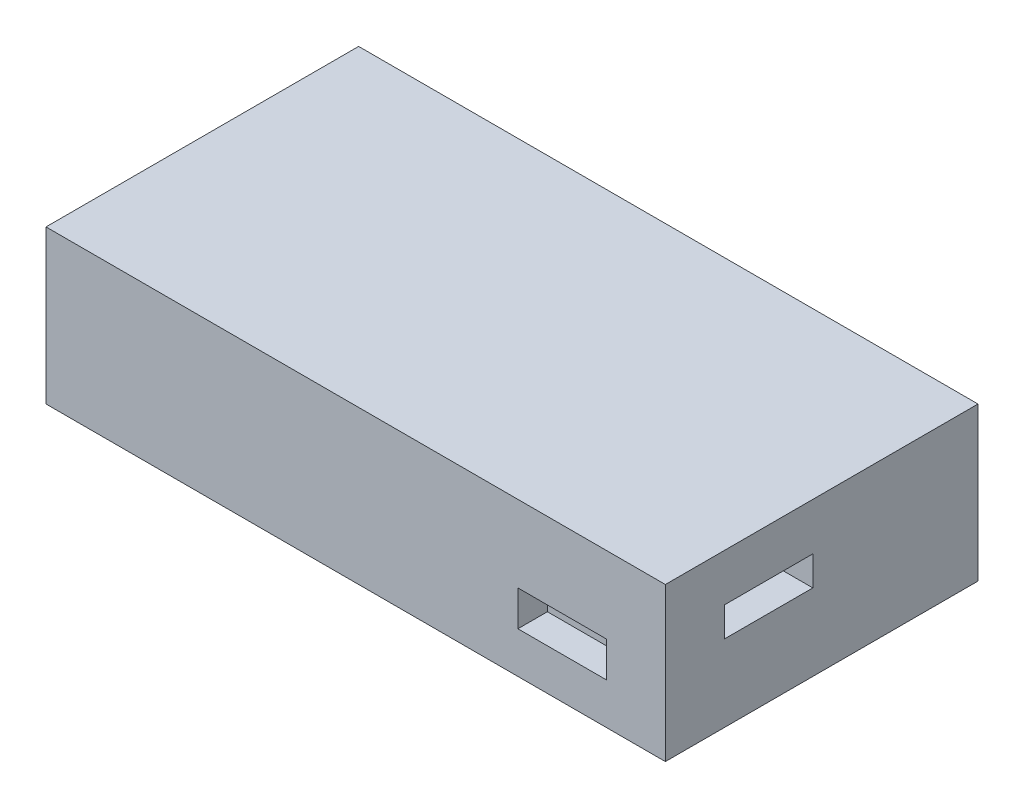
ISO-10303-21;
HEADER;
FILE_DESCRIPTION(('STEP AP214'),'2;1');
FILE_NAME('part.step','',(''),(''),'','','');
FILE_SCHEMA(('AUTOMOTIVE_DESIGN { 1 0 10303 214 1 1 1 1 }'));
ENDSEC;
DATA;
#1=APPLICATION_CONTEXT('core data for automotive mechanical design processes');
#2=APPLICATION_PROTOCOL_DEFINITION('international standard','automotive_design',2000,#1);
#3=PRODUCT_CONTEXT('',#1,'mechanical');
#4=PRODUCT('Part','Part','',(#3));
#5=PRODUCT_RELATED_PRODUCT_CATEGORY('part','',(#4));
#6=PRODUCT_DEFINITION_FORMATION('','',#4);
#7=PRODUCT_DEFINITION_CONTEXT('part definition',#1,'design');
#8=PRODUCT_DEFINITION('design','',#6,#7);
#9=PRODUCT_DEFINITION_SHAPE('','',#8);
#10=(LENGTH_UNIT() NAMED_UNIT(*) SI_UNIT(.MILLI.,.METRE.));
#11=(NAMED_UNIT(*) PLANE_ANGLE_UNIT() SI_UNIT($,.RADIAN.));
#12=(NAMED_UNIT(*) SI_UNIT($,.STERADIAN.) SOLID_ANGLE_UNIT());
#13=UNCERTAINTY_MEASURE_WITH_UNIT(LENGTH_MEASURE(1.E-05),#10,'distance_accuracy_value','');
#14=(GEOMETRIC_REPRESENTATION_CONTEXT(3) GLOBAL_UNCERTAINTY_ASSIGNED_CONTEXT((#13)) GLOBAL_UNIT_ASSIGNED_CONTEXT((#10,
#11,#12)) REPRESENTATION_CONTEXT('',''));
#15=CARTESIAN_POINT('',(0.,0.,0.));
#16=DIRECTION('',(0.,0.,1.));
#17=DIRECTION('',(1.,0.,0.));
#18=AXIS2_PLACEMENT_3D('',#15,#16,#17);
#19=CARTESIAN_POINT('',(0.,26.,0.));
#20=DIRECTION('',(1.,0.,0.));
#21=DIRECTION('',(0.,0.,-1.));
#22=AXIS2_PLACEMENT_3D('',#19,#20,#21);
#23=PLANE('',#22);
#24=DIRECTION('',(0.,0.,1.));
#25=VECTOR('',#24,1.);
#26=CARTESIAN_POINT('',(0.,0.,0.));
#27=LINE('',#26,#25);
#28=CARTESIAN_POINT('',(0.,0.,-53.));
#29=VERTEX_POINT('',#28);
#30=CARTESIAN_POINT('',(0.,0.,0.));
#31=VERTEX_POINT('',#30);
#32=EDGE_CURVE('E211',#29,#31,#27,.T.);
#33=ORIENTED_EDGE('',*,*,#32,.T.);
#34=DIRECTION('',(0.,-1.,0.));
#35=VECTOR('',#34,1.);
#36=CARTESIAN_POINT('',(0.,26.,0.));
#37=LINE('',#36,#35);
#38=CARTESIAN_POINT('',(0.,26.,0.));
#39=VERTEX_POINT('',#38);
#40=EDGE_CURVE('E11',#39,#31,#37,.T.);
#41=ORIENTED_EDGE('',*,*,#40,.F.);
#42=DIRECTION('',(0.,0.,1.));
#43=VECTOR('',#42,1.);
#44=CARTESIAN_POINT('',(0.,26.,0.));
#45=LINE('',#44,#43);
#46=CARTESIAN_POINT('',(0.,26.,-53.));
#47=VERTEX_POINT('',#46);
#48=EDGE_CURVE('E220',#47,#39,#45,.T.);
#49=ORIENTED_EDGE('',*,*,#48,.F.);
#50=DIRECTION('',(0.,-1.,0.));
#51=VECTOR('',#50,1.);
#52=CARTESIAN_POINT('',(0.,26.,-53.));
#53=LINE('',#52,#51);
#54=EDGE_CURVE('E234',#47,#29,#53,.T.);
#55=ORIENTED_EDGE('',*,*,#54,.T.);
#56=EDGE_LOOP('',(#33,#41,#49,#55));
#57=FACE_BOUND('',#56,.T.);
#58=ADVANCED_FACE('F38',(#57),#23,.F.);
#59=CARTESIAN_POINT('',(0.,26.,0.));
#60=DIRECTION('',(0.,0.,-1.));
#61=DIRECTION('',(-1.,0.,0.));
#62=AXIS2_PLACEMENT_3D('',#59,#60,#61);
#63=PLANE('',#62);
#64=DIRECTION('',(-1.,0.,0.));
#65=VECTOR('',#64,1.);
#66=CARTESIAN_POINT('',(80.,13.,0.));
#67=LINE('',#66,#65);
#68=CARTESIAN_POINT('',(95.,13.,0.));
#69=VERTEX_POINT('',#68);
#70=CARTESIAN_POINT('',(80.,13.,0.));
#71=VERTEX_POINT('',#70);
#72=EDGE_CURVE('E197',#69,#71,#67,.T.);
#73=ORIENTED_EDGE('',*,*,#72,.F.);
#74=DIRECTION('',(0.,1.,0.));
#75=VECTOR('',#74,1.);
#76=CARTESIAN_POINT('',(95.,13.,0.));
#77=LINE('',#76,#75);
#78=CARTESIAN_POINT('',(95.,7.,0.));
#79=VERTEX_POINT('',#78);
#80=EDGE_CURVE('E61',#79,#69,#77,.T.);
#81=ORIENTED_EDGE('',*,*,#80,.F.);
#82=DIRECTION('',(1.,0.,0.));
#83=VECTOR('',#82,1.);
#84=CARTESIAN_POINT('',(95.,7.,0.));
#85=LINE('',#84,#83);
#86=CARTESIAN_POINT('',(80.,7.,0.));
#87=VERTEX_POINT('',#86);
#88=EDGE_CURVE('E182',#87,#79,#85,.T.);
#89=ORIENTED_EDGE('',*,*,#88,.F.);
#90=DIRECTION('',(0.,-1.,0.));
#91=VECTOR('',#90,1.);
#92=CARTESIAN_POINT('',(80.,7.,0.));
#93=LINE('',#92,#91);
#94=EDGE_CURVE('E201',#71,#87,#93,.T.);
#95=ORIENTED_EDGE('',*,*,#94,.F.);
#96=EDGE_LOOP('',(#73,#81,#89,#95));
#97=FACE_BOUND('',#96,.T.);
#98=DIRECTION('',(1.,0.,0.));
#99=VECTOR('',#98,1.);
#100=CARTESIAN_POINT('',(0.,0.,0.));
#101=LINE('',#100,#99);
#102=CARTESIAN_POINT('',(105.,0.,0.));
#103=VERTEX_POINT('',#102);
#104=EDGE_CURVE('E238',#31,#103,#101,.T.);
#105=ORIENTED_EDGE('',*,*,#104,.T.);
#106=DIRECTION('',(0.,-1.,0.));
#107=VECTOR('',#106,1.);
#108=CARTESIAN_POINT('',(105.,26.,0.));
#109=LINE('',#108,#107);
#110=CARTESIAN_POINT('',(105.,26.,0.));
#111=VERTEX_POINT('',#110);
#112=EDGE_CURVE('E46',#111,#103,#109,.T.);
#113=ORIENTED_EDGE('',*,*,#112,.F.);
#114=DIRECTION('',(1.,0.,0.));
#115=VECTOR('',#114,1.);
#116=CARTESIAN_POINT('',(0.,26.,0.));
#117=LINE('',#116,#115);
#118=EDGE_CURVE('E224',#39,#111,#117,.T.);
#119=ORIENTED_EDGE('',*,*,#118,.F.);
#120=ORIENTED_EDGE('',*,*,#40,.T.);
#121=EDGE_LOOP('',(#105,#113,#119,#120));
#122=FACE_BOUND('',#121,.T.);
#123=ADVANCED_FACE('F274',(#97,#122),#63,.F.);
#124=CARTESIAN_POINT('',(105.,26.,0.));
#125=DIRECTION('',(-1.,0.,0.));
#126=DIRECTION('',(0.,0.,1.));
#127=AXIS2_PLACEMENT_3D('',#124,#125,#126);
#128=PLANE('',#127);
#129=DIRECTION('',(0.,-1.,0.));
#130=VECTOR('',#129,1.);
#131=CARTESIAN_POINT('',(105.,18.,-10.));
#132=LINE('',#131,#130);
#133=CARTESIAN_POINT('',(105.,18.,-10.));
#134=VERTEX_POINT('',#133);
#135=CARTESIAN_POINT('',(105.,13.,-10.));
#136=VERTEX_POINT('',#135);
#137=EDGE_CURVE('E163',#134,#136,#132,.T.);
#138=ORIENTED_EDGE('',*,*,#137,.F.);
#139=DIRECTION('',(0.,0.,1.));
#140=VECTOR('',#139,1.);
#141=CARTESIAN_POINT('',(105.,18.,-25.));
#142=LINE('',#141,#140);
#143=CARTESIAN_POINT('',(105.,18.,-25.));
#144=VERTEX_POINT('',#143);
#145=EDGE_CURVE('E53',#144,#134,#142,.T.);
#146=ORIENTED_EDGE('',*,*,#145,.F.);
#147=DIRECTION('',(0.,1.,0.));
#148=VECTOR('',#147,1.);
#149=CARTESIAN_POINT('',(105.,13.,-25.));
#150=LINE('',#149,#148);
#151=CARTESIAN_POINT('',(105.,13.,-25.));
#152=VERTEX_POINT('',#151);
#153=EDGE_CURVE('E150',#152,#144,#150,.T.);
#154=ORIENTED_EDGE('',*,*,#153,.F.);
#155=DIRECTION('',(0.,0.,-1.));
#156=VECTOR('',#155,1.);
#157=CARTESIAN_POINT('',(105.,13.,-10.));
#158=LINE('',#157,#156);
#159=EDGE_CURVE('E154',#136,#152,#158,.T.);
#160=ORIENTED_EDGE('',*,*,#159,.F.);
#161=EDGE_LOOP('',(#138,#146,#154,#160));
#162=FACE_BOUND('',#161,.T.);
#163=DIRECTION('',(0.,0.,-1.));
#164=VECTOR('',#163,1.);
#165=CARTESIAN_POINT('',(105.,0.,0.));
#166=LINE('',#165,#164);
#167=CARTESIAN_POINT('',(105.,0.,-53.));
#168=VERTEX_POINT('',#167);
#169=EDGE_CURVE('E241',#103,#168,#166,.T.);
#170=ORIENTED_EDGE('',*,*,#169,.T.);
#171=DIRECTION('',(0.,-1.,0.));
#172=VECTOR('',#171,1.);
#173=CARTESIAN_POINT('',(105.,26.,-53.));
#174=LINE('',#173,#172);
#175=CARTESIAN_POINT('',(105.,26.,-53.));
#176=VERTEX_POINT('',#175);
#177=EDGE_CURVE('E249',#176,#168,#174,.T.);
#178=ORIENTED_EDGE('',*,*,#177,.F.);
#179=DIRECTION('',(0.,0.,-1.));
#180=VECTOR('',#179,1.);
#181=CARTESIAN_POINT('',(105.,26.,0.));
#182=LINE('',#181,#180);
#183=EDGE_CURVE('E228',#111,#176,#182,.T.);
#184=ORIENTED_EDGE('',*,*,#183,.F.);
#185=ORIENTED_EDGE('',*,*,#112,.T.);
#186=EDGE_LOOP('',(#170,#178,#184,#185));
#187=FACE_BOUND('',#186,.T.);
#188=ADVANCED_FACE('F258',(#162,#187),#128,.F.);
#189=CARTESIAN_POINT('',(0.,26.,-53.));
#190=DIRECTION('',(0.,0.,1.));
#191=DIRECTION('',(1.,0.,0.));
#192=AXIS2_PLACEMENT_3D('',#189,#190,#191);
#193=PLANE('',#192);
#194=DIRECTION('',(-1.,0.,0.));
#195=VECTOR('',#194,1.);
#196=CARTESIAN_POINT('',(0.,0.,-53.));
#197=LINE('',#196,#195);
#198=EDGE_CURVE('E225',#168,#29,#197,.T.);
#199=ORIENTED_EDGE('',*,*,#198,.T.);
#200=ORIENTED_EDGE('',*,*,#54,.F.);
#201=DIRECTION('',(-1.,0.,0.));
#202=VECTOR('',#201,1.);
#203=CARTESIAN_POINT('',(0.,26.,-53.));
#204=LINE('',#203,#202);
#205=EDGE_CURVE('E231',#176,#47,#204,.T.);
#206=ORIENTED_EDGE('',*,*,#205,.F.);
#207=ORIENTED_EDGE('',*,*,#177,.T.);
#208=EDGE_LOOP('',(#199,#200,#206,#207));
#209=FACE_BOUND('',#208,.T.);
#210=ADVANCED_FACE('F267',(#209),#193,.F.);
#211=CARTESIAN_POINT('',(0.,26.,0.));
#212=DIRECTION('',(0.,-1.,0.));
#213=DIRECTION('',(0.,0.,-1.));
#214=AXIS2_PLACEMENT_3D('',#211,#212,#213);
#215=PLANE('',#214);
#216=ORIENTED_EDGE('',*,*,#48,.T.);
#217=ORIENTED_EDGE('',*,*,#118,.T.);
#218=ORIENTED_EDGE('',*,*,#183,.T.);
#219=ORIENTED_EDGE('',*,*,#205,.T.);
#220=EDGE_LOOP('',(#216,#217,#218,#219));
#221=FACE_BOUND('',#220,.T.);
#222=ADVANCED_FACE('F273',(#221),#215,.F.);
#223=CARTESIAN_POINT('',(0.,0.,0.));
#224=DIRECTION('',(0.,-1.,0.));
#225=DIRECTION('',(0.,0.,-1.));
#226=AXIS2_PLACEMENT_3D('',#223,#224,#225);
#227=PLANE('',#226);
#228=ORIENTED_EDGE('',*,*,#32,.F.);
#229=ORIENTED_EDGE('',*,*,#198,.F.);
#230=ORIENTED_EDGE('',*,*,#169,.F.);
#231=ORIENTED_EDGE('',*,*,#104,.F.);
#232=EDGE_LOOP('',(#228,#229,#230,#231));
#233=FACE_BOUND('',#232,.T.);
#234=ADVANCED_FACE('F264',(#233),#227,.T.);
#235=CARTESIAN_POINT('',(95.,13.,-5.));
#236=DIRECTION('',(1.,0.,0.));
#237=DIRECTION('',(0.,0.,-1.));
#238=AXIS2_PLACEMENT_3D('',#235,#236,#237);
#239=PLANE('',#238);
#240=ORIENTED_EDGE('',*,*,#80,.T.);
#241=DIRECTION('',(0.,0.,1.));
#242=VECTOR('',#241,1.);
#243=CARTESIAN_POINT('',(95.,13.,-5.));
#244=LINE('',#243,#242);
#245=CARTESIAN_POINT('',(95.,13.,-5.));
#246=VERTEX_POINT('',#245);
#247=EDGE_CURVE('E194',#246,#69,#244,.T.);
#248=ORIENTED_EDGE('',*,*,#247,.F.);
#249=DIRECTION('',(0.,1.,0.));
#250=VECTOR('',#249,1.);
#251=CARTESIAN_POINT('',(95.,13.,-5.));
#252=LINE('',#251,#250);
#253=CARTESIAN_POINT('',(95.,7.,-5.));
#254=VERTEX_POINT('',#253);
#255=EDGE_CURVE('E177',#254,#246,#252,.T.);
#256=ORIENTED_EDGE('',*,*,#255,.F.);
#257=DIRECTION('',(0.,0.,1.));
#258=VECTOR('',#257,1.);
#259=CARTESIAN_POINT('',(95.,7.,-5.));
#260=LINE('',#259,#258);
#261=EDGE_CURVE('E208',#254,#79,#260,.T.);
#262=ORIENTED_EDGE('',*,*,#261,.T.);
#263=EDGE_LOOP('',(#240,#248,#256,#262));
#264=FACE_BOUND('',#263,.T.);
#265=ADVANCED_FACE('F290',(#264),#239,.F.);
#266=CARTESIAN_POINT('',(95.,7.,-5.));
#267=DIRECTION('',(0.,-1.,0.));
#268=DIRECTION('',(1.,0.,0.));
#269=AXIS2_PLACEMENT_3D('',#266,#267,#268);
#270=PLANE('',#269);
#271=ORIENTED_EDGE('',*,*,#88,.T.);
#272=ORIENTED_EDGE('',*,*,#261,.F.);
#273=DIRECTION('',(1.,0.,0.));
#274=VECTOR('',#273,1.);
#275=CARTESIAN_POINT('',(95.,7.,-5.));
#276=LINE('',#275,#274);
#277=CARTESIAN_POINT('',(80.,7.,-5.));
#278=VERTEX_POINT('',#277);
#279=EDGE_CURVE('E190',#278,#254,#276,.T.);
#280=ORIENTED_EDGE('',*,*,#279,.F.);
#281=DIRECTION('',(0.,0.,1.));
#282=VECTOR('',#281,1.);
#283=CARTESIAN_POINT('',(80.,7.,-5.));
#284=LINE('',#283,#282);
#285=EDGE_CURVE('E212',#278,#87,#284,.T.);
#286=ORIENTED_EDGE('',*,*,#285,.T.);
#287=EDGE_LOOP('',(#271,#272,#280,#286));
#288=FACE_BOUND('',#287,.T.);
#289=ADVANCED_FACE('F295',(#288),#270,.F.);
#290=CARTESIAN_POINT('',(80.,7.,-5.));
#291=DIRECTION('',(-1.,0.,0.));
#292=DIRECTION('',(0.,0.,1.));
#293=AXIS2_PLACEMENT_3D('',#290,#291,#292);
#294=PLANE('',#293);
#295=ORIENTED_EDGE('',*,*,#94,.T.);
#296=ORIENTED_EDGE('',*,*,#285,.F.);
#297=DIRECTION('',(0.,-1.,0.));
#298=VECTOR('',#297,1.);
#299=CARTESIAN_POINT('',(80.,7.,-5.));
#300=LINE('',#299,#298);
#301=CARTESIAN_POINT('',(80.,13.,-5.));
#302=VERTEX_POINT('',#301);
#303=EDGE_CURVE('E186',#302,#278,#300,.T.);
#304=ORIENTED_EDGE('',*,*,#303,.F.);
#305=DIRECTION('',(0.,0.,1.));
#306=VECTOR('',#305,1.);
#307=CARTESIAN_POINT('',(80.,13.,-5.));
#308=LINE('',#307,#306);
#309=EDGE_CURVE('E215',#302,#71,#308,.T.);
#310=ORIENTED_EDGE('',*,*,#309,.T.);
#311=EDGE_LOOP('',(#295,#296,#304,#310));
#312=FACE_BOUND('',#311,.T.);
#313=ADVANCED_FACE('F300',(#312),#294,.F.);
#314=CARTESIAN_POINT('',(80.,13.,-5.));
#315=DIRECTION('',(0.,1.,0.));
#316=DIRECTION('',(0.,0.,1.));
#317=AXIS2_PLACEMENT_3D('',#314,#315,#316);
#318=PLANE('',#317);
#319=ORIENTED_EDGE('',*,*,#72,.T.);
#320=ORIENTED_EDGE('',*,*,#309,.F.);
#321=DIRECTION('',(-1.,0.,0.));
#322=VECTOR('',#321,1.);
#323=CARTESIAN_POINT('',(80.,13.,-5.));
#324=LINE('',#323,#322);
#325=EDGE_CURVE('E181',#246,#302,#324,.T.);
#326=ORIENTED_EDGE('',*,*,#325,.F.);
#327=ORIENTED_EDGE('',*,*,#247,.T.);
#328=EDGE_LOOP('',(#319,#320,#326,#327));
#329=FACE_BOUND('',#328,.T.);
#330=ADVANCED_FACE('F296',(#329),#318,.F.);
#331=CARTESIAN_POINT('',(0.,0.,-5.));
#332=DIRECTION('',(0.,0.,-1.));
#333=DIRECTION('',(-1.,0.,0.));
#334=AXIS2_PLACEMENT_3D('',#331,#332,#333);
#335=PLANE('',#334);
#336=ORIENTED_EDGE('',*,*,#255,.T.);
#337=ORIENTED_EDGE('',*,*,#325,.T.);
#338=ORIENTED_EDGE('',*,*,#303,.T.);
#339=ORIENTED_EDGE('',*,*,#279,.T.);
#340=EDGE_LOOP('',(#336,#337,#338,#339));
#341=FACE_BOUND('',#340,.T.);
#342=ADVANCED_FACE('F299',(#341),#335,.F.);
#343=CARTESIAN_POINT('',(95.,18.,-25.));
#344=DIRECTION('',(0.,1.,0.));
#345=DIRECTION('',(0.,0.,1.));
#346=AXIS2_PLACEMENT_3D('',#343,#344,#345);
#347=PLANE('',#346);
#348=ORIENTED_EDGE('',*,*,#145,.T.);
#349=DIRECTION('',(1.,0.,0.));
#350=VECTOR('',#349,1.);
#351=CARTESIAN_POINT('',(95.,18.,-10.));
#352=LINE('',#351,#350);
#353=CARTESIAN_POINT('',(95.,18.,-10.));
#354=VERTEX_POINT('',#353);
#355=EDGE_CURVE('E125',#354,#134,#352,.T.);
#356=ORIENTED_EDGE('',*,*,#355,.F.);
#357=DIRECTION('',(0.,0.,1.));
#358=VECTOR('',#357,1.);
#359=CARTESIAN_POINT('',(95.,18.,-25.));
#360=LINE('',#359,#358);
#361=CARTESIAN_POINT('',(95.,18.,-25.));
#362=VERTEX_POINT('',#361);
#363=EDGE_CURVE('E129',#362,#354,#360,.T.);
#364=ORIENTED_EDGE('',*,*,#363,.F.);
#365=DIRECTION('',(1.,0.,0.));
#366=VECTOR('',#365,1.);
#367=CARTESIAN_POINT('',(95.,18.,-25.));
#368=LINE('',#367,#366);
#369=EDGE_CURVE('E169',#362,#144,#368,.T.);
#370=ORIENTED_EDGE('',*,*,#369,.T.);
#371=EDGE_LOOP('',(#348,#356,#364,#370));
#372=FACE_BOUND('',#371,.T.);
#373=ADVANCED_FACE('F127',(#372),#347,.F.);
#374=CARTESIAN_POINT('',(95.,13.,-25.));
#375=DIRECTION('',(0.,0.,-1.));
#376=DIRECTION('',(-1.,0.,0.));
#377=AXIS2_PLACEMENT_3D('',#374,#375,#376);
#378=PLANE('',#377);
#379=ORIENTED_EDGE('',*,*,#153,.T.);
#380=ORIENTED_EDGE('',*,*,#369,.F.);
#381=DIRECTION('',(0.,1.,0.));
#382=VECTOR('',#381,1.);
#383=CARTESIAN_POINT('',(95.,13.,-25.));
#384=LINE('',#383,#382);
#385=CARTESIAN_POINT('',(95.,13.,-25.));
#386=VERTEX_POINT('',#385);
#387=EDGE_CURVE('E136',#386,#362,#384,.T.);
#388=ORIENTED_EDGE('',*,*,#387,.F.);
#389=DIRECTION('',(1.,0.,0.));
#390=VECTOR('',#389,1.);
#391=CARTESIAN_POINT('',(95.,13.,-25.));
#392=LINE('',#391,#390);
#393=EDGE_CURVE('E172',#386,#152,#392,.T.);
#394=ORIENTED_EDGE('',*,*,#393,.T.);
#395=EDGE_LOOP('',(#379,#380,#388,#394));
#396=FACE_BOUND('',#395,.T.);
#397=ADVANCED_FACE('F313',(#396),#378,.F.);
#398=CARTESIAN_POINT('',(95.,13.,-10.));
#399=DIRECTION('',(0.,-1.,0.));
#400=DIRECTION('',(0.,0.,-1.));
#401=AXIS2_PLACEMENT_3D('',#398,#399,#400);
#402=PLANE('',#401);
#403=ORIENTED_EDGE('',*,*,#159,.T.);
#404=ORIENTED_EDGE('',*,*,#393,.F.);
#405=DIRECTION('',(0.,0.,-1.));
#406=VECTOR('',#405,1.);
#407=CARTESIAN_POINT('',(95.,13.,-10.));
#408=LINE('',#407,#406);
#409=CARTESIAN_POINT('',(95.,13.,-10.));
#410=VERTEX_POINT('',#409);
#411=EDGE_CURVE('E145',#410,#386,#408,.T.);
#412=ORIENTED_EDGE('',*,*,#411,.F.);
#413=DIRECTION('',(1.,0.,0.));
#414=VECTOR('',#413,1.);
#415=CARTESIAN_POINT('',(95.,13.,-10.));
#416=LINE('',#415,#414);
#417=EDGE_CURVE('E135',#410,#136,#416,.T.);
#418=ORIENTED_EDGE('',*,*,#417,.T.);
#419=EDGE_LOOP('',(#403,#404,#412,#418));
#420=FACE_BOUND('',#419,.T.);
#421=ADVANCED_FACE('F316',(#420),#402,.F.);
#422=CARTESIAN_POINT('',(95.,18.,-10.));
#423=DIRECTION('',(0.,0.,1.));
#424=DIRECTION('',(1.,0.,0.));
#425=AXIS2_PLACEMENT_3D('',#422,#423,#424);
#426=PLANE('',#425);
#427=ORIENTED_EDGE('',*,*,#137,.T.);
#428=ORIENTED_EDGE('',*,*,#417,.F.);
#429=DIRECTION('',(0.,-1.,0.));
#430=VECTOR('',#429,1.);
#431=CARTESIAN_POINT('',(95.,18.,-10.));
#432=LINE('',#431,#430);
#433=EDGE_CURVE('E139',#354,#410,#432,.T.);
#434=ORIENTED_EDGE('',*,*,#433,.F.);
#435=ORIENTED_EDGE('',*,*,#355,.T.);
#436=EDGE_LOOP('',(#427,#428,#434,#435));
#437=FACE_BOUND('',#436,.T.);
#438=ADVANCED_FACE('F140',(#437),#426,.F.);
#439=CARTESIAN_POINT('',(95.,0.,0.));
#440=DIRECTION('',(1.,0.,0.));
#441=DIRECTION('',(0.,0.,-1.));
#442=AXIS2_PLACEMENT_3D('',#439,#440,#441);
#443=PLANE('',#442);
#444=ORIENTED_EDGE('',*,*,#363,.T.);
#445=ORIENTED_EDGE('',*,*,#433,.T.);
#446=ORIENTED_EDGE('',*,*,#411,.T.);
#447=ORIENTED_EDGE('',*,*,#387,.T.);
#448=EDGE_LOOP('',(#444,#445,#446,#447));
#449=FACE_BOUND('',#448,.T.);
#450=ADVANCED_FACE('F147',(#449),#443,.T.);
#451=CLOSED_SHELL('',(#58,#123,#188,#210,#222,#234,#265,#289,#313,#330,#342,#373,#397,#421,#438,#450));
#452=MANIFOLD_SOLID_BREP('B2',#451);
#453=ADVANCED_BREP_SHAPE_REPRESENTATION('',(#18,#452),#14);
#454=SHAPE_DEFINITION_REPRESENTATION(#9,#453);
ENDSEC;
END-ISO-10303-21;
